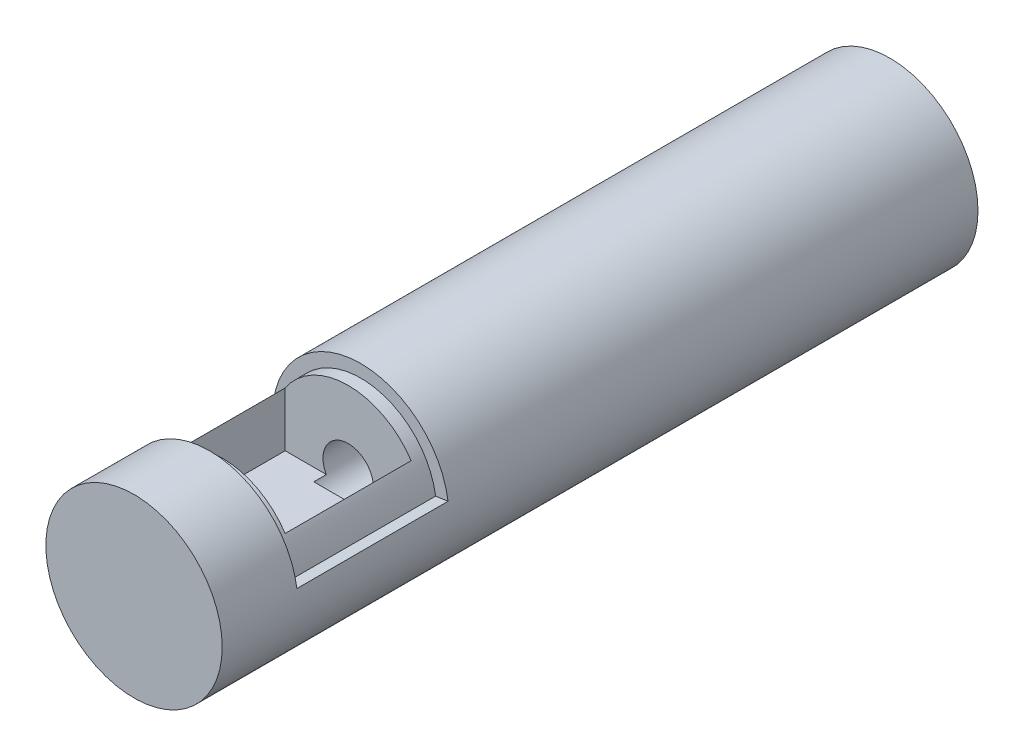
ISO-10303-21;
HEADER;
FILE_DESCRIPTION(('STEP AP214'),'2;1');
FILE_NAME('part.step','',(''),(''),'','','');
FILE_SCHEMA(('AUTOMOTIVE_DESIGN { 1 0 10303 214 1 1 1 1 }'));
ENDSEC;
DATA;
#1=APPLICATION_CONTEXT('core data for automotive mechanical design processes');
#2=APPLICATION_PROTOCOL_DEFINITION('international standard','automotive_design',2000,#1);
#3=PRODUCT_CONTEXT('',#1,'mechanical');
#4=PRODUCT('Part','Part','',(#3));
#5=PRODUCT_RELATED_PRODUCT_CATEGORY('part','',(#4));
#6=PRODUCT_DEFINITION_FORMATION('','',#4);
#7=PRODUCT_DEFINITION_CONTEXT('part definition',#1,'design');
#8=PRODUCT_DEFINITION('design','',#6,#7);
#9=PRODUCT_DEFINITION_SHAPE('','',#8);
#10=(LENGTH_UNIT() NAMED_UNIT(*) SI_UNIT(.MILLI.,.METRE.));
#11=(NAMED_UNIT(*) PLANE_ANGLE_UNIT() SI_UNIT($,.RADIAN.));
#12=(NAMED_UNIT(*) SI_UNIT($,.STERADIAN.) SOLID_ANGLE_UNIT());
#13=UNCERTAINTY_MEASURE_WITH_UNIT(LENGTH_MEASURE(1.E-05),#10,'distance_accuracy_value','');
#14=(GEOMETRIC_REPRESENTATION_CONTEXT(3) GLOBAL_UNCERTAINTY_ASSIGNED_CONTEXT((#13)) GLOBAL_UNIT_ASSIGNED_CONTEXT((#10,
#11,#12)) REPRESENTATION_CONTEXT('',''));
#15=CARTESIAN_POINT('',(0.,0.,0.));
#16=DIRECTION('',(0.,0.,1.));
#17=DIRECTION('',(1.,0.,0.));
#18=AXIS2_PLACEMENT_3D('',#15,#16,#17);
#19=CARTESIAN_POINT('',(0.,0.,-50.8));
#20=DIRECTION('',(0.,0.,-1.));
#21=DIRECTION('',(-1.,0.,0.));
#22=AXIS2_PLACEMENT_3D('',#19,#20,#21);
#23=CYLINDRICAL_SURFACE('',#22,6.35);
#24=CARTESIAN_POINT('',(0.,0.,-174.625));
#25=DIRECTION('',(0.,0.707106781186547,-0.707106781186547));
#26=DIRECTION('',(0.,-0.707106781186547,-0.707106781186547));
#27=AXIS2_PLACEMENT_3D('',#24,#25,#26);
#28=ELLIPSE('',#27,8.98025612106915,6.35);
#29=CARTESIAN_POINT('',(-6.35,0.,-174.625));
#30=VERTEX_POINT('',#29);
#31=CARTESIAN_POINT('',(6.35,0.,-174.625));
#32=VERTEX_POINT('',#31);
#33=EDGE_CURVE('E146',#30,#32,#28,.F.);
#34=ORIENTED_EDGE('',*,*,#33,.T.);
#35=CARTESIAN_POINT('',(0.,0.,-174.625));
#36=DIRECTION('',(0.,-0.707106781186547,-0.707106781186547));
#37=DIRECTION('',(0.,0.707106781186547,-0.707106781186547));
#38=AXIS2_PLACEMENT_3D('',#35,#36,#37);
#39=ELLIPSE('',#38,8.98025612106915,6.35);
#40=EDGE_CURVE('E79',#32,#30,#39,.T.);
#41=ORIENTED_EDGE('',*,*,#40,.T.);
#42=EDGE_LOOP('',(#34,#41));
#43=FACE_BOUND('',#42,.T.);
#44=CARTESIAN_POINT('',(0.,0.,-190.5));
#45=DIRECTION('',(0.,0.,-1.));
#46=DIRECTION('',(-1.,0.,0.));
#47=AXIS2_PLACEMENT_3D('',#44,#45,#46);
#48=CIRCLE('',#47,6.35);
#49=CARTESIAN_POINT('',(-6.35,0.,-190.5));
#50=VERTEX_POINT('',#49);
#51=EDGE_CURVE('E228',#50,#50,#48,.T.);
#52=ORIENTED_EDGE('',*,*,#51,.T.);
#53=EDGE_LOOP('',(#52));
#54=FACE_BOUND('',#53,.T.);
#55=DIRECTION('',(0.,0.,-1.));
#56=VECTOR('',#55,1.);
#57=CARTESIAN_POINT('',(5.49926131403118,-3.175,-50.8));
#58=LINE('',#57,#56);
#59=CARTESIAN_POINT('',(5.49926131403118,-3.175,-53.975));
#60=VERTEX_POINT('',#59);
#61=CARTESIAN_POINT('',(5.49926131403118,-3.175,-50.8));
#62=VERTEX_POINT('',#61);
#63=EDGE_CURVE('E87',#60,#62,#58,.F.);
#64=ORIENTED_EDGE('',*,*,#63,.F.);
#65=CARTESIAN_POINT('',(0.,0.,-53.975));
#66=DIRECTION('',(0.,0.,-1.));
#67=DIRECTION('',(-1.,0.,0.));
#68=AXIS2_PLACEMENT_3D('',#65,#66,#67);
#69=CIRCLE('',#68,6.35);
#70=CARTESIAN_POINT('',(-5.49926131403118,-3.175,-53.975));
#71=VERTEX_POINT('',#70);
#72=EDGE_CURVE('E177',#60,#71,#69,.F.);
#73=ORIENTED_EDGE('',*,*,#72,.T.);
#74=DIRECTION('',(0.,0.,-1.));
#75=VECTOR('',#74,1.);
#76=CARTESIAN_POINT('',(-5.49926131403118,-3.175,-50.8));
#77=LINE('',#76,#75);
#78=CARTESIAN_POINT('',(-5.49926131403118,-3.175,-50.8));
#79=VERTEX_POINT('',#78);
#80=EDGE_CURVE('E187',#79,#71,#77,.T.);
#81=ORIENTED_EDGE('',*,*,#80,.F.);
#82=CARTESIAN_POINT('',(0.,0.,-50.8));
#83=DIRECTION('',(0.,0.,-1.));
#84=DIRECTION('',(-1.,0.,0.));
#85=AXIS2_PLACEMENT_3D('',#82,#83,#84);
#86=CIRCLE('',#85,6.35);
#87=EDGE_CURVE('E231',#62,#79,#86,.T.);
#88=ORIENTED_EDGE('',*,*,#87,.F.);
#89=EDGE_LOOP('',(#64,#73,#81,#88));
#90=FACE_BOUND('',#89,.T.);
#91=ADVANCED_FACE('F61',(#43,#54,#90),#23,.F.);
#92=CARTESIAN_POINT('',(0.,0.,-50.8));
#93=DIRECTION('',(0.,0.,-1.));
#94=DIRECTION('',(-1.,0.,0.));
#95=AXIS2_PLACEMENT_3D('',#92,#93,#94);
#96=PLANE('',#95);
#97=ORIENTED_EDGE('',*,*,#87,.T.);
#98=DIRECTION('',(1.,0.,0.));
#99=VECTOR('',#98,1.);
#100=CARTESIAN_POINT('',(0.,-3.175,-50.8));
#101=LINE('',#100,#99);
#102=EDGE_CURVE('E73',#79,#62,#101,.T.);
#103=ORIENTED_EDGE('',*,*,#102,.T.);
#104=EDGE_LOOP('',(#97,#103));
#105=FACE_BOUND('',#104,.T.);
#106=ADVANCED_FACE('F284',(#105),#96,.T.);
#107=CARTESIAN_POINT('',(0.,0.,-190.5));
#108=DIRECTION('',(0.,0.,1.));
#109=DIRECTION('',(1.,0.,0.));
#110=AXIS2_PLACEMENT_3D('',#107,#108,#109);
#111=CYLINDRICAL_SURFACE('',#110,22.225);
#112=CARTESIAN_POINT('',(0.,-22.225,-180.975));
#113=CARTESIAN_POINT('',(0.174607225843672,-22.22500466078,-180.975007000145));
#114=CARTESIAN_POINT('',(0.349145676414636,-22.2229397533426,-180.96779789574));
#115=CARTESIAN_POINT('',(0.696988519144419,-22.2147481167108,-180.939042280245));
#116=CARTESIAN_POINT('',(0.870292828276681,-22.2086211168013,-180.917494813585));
#117=CARTESIAN_POINT('',(1.21437514514276,-22.1924673773701,-180.860240793684));
#118=CARTESIAN_POINT('',(1.38515279448038,-22.182440090011,-180.824532251352));
#119=CARTESIAN_POINT('',(1.72302009773866,-22.1587570214081,-180.739251134518));
#120=CARTESIAN_POINT('',(1.89010836488564,-22.1450999000995,-180.689673439435));
#121=CARTESIAN_POINT('',(2.2190834151464,-22.1145548995916,-180.577170697377));
#122=CARTESIAN_POINT('',(2.3809789965358,-22.0976728635878,-180.514269768564));
#123=CARTESIAN_POINT('',(2.6988690410669,-22.0611047907319,-180.375538817594));
#124=CARTESIAN_POINT('',(2.85486129536683,-22.0414177171969,-180.299704013298));
#125=CARTESIAN_POINT('',(3.15984930758175,-21.999764787099,-180.135699706395));
#126=CARTESIAN_POINT('',(3.30884717023756,-21.977799622524,-180.047533946592));
#127=CARTESIAN_POINT('',(3.59899575566578,-21.932156038399,-179.859468734321));
#128=CARTESIAN_POINT('',(3.74014344013891,-21.9084769635531,-179.759564784682));
#129=CARTESIAN_POINT('',(4.15683584601096,-21.8346494476341,-179.438308080656));
#130=CARTESIAN_POINT('',(4.4186521664173,-21.7827038931198,-179.1991587917));
#131=CARTESIAN_POINT('',(4.89900472413623,-21.6797370204422,-178.680515018604));
#132=CARTESIAN_POINT('',(5.11753447188942,-21.6287158419022,-178.401014495815));
#133=CARTESIAN_POINT('',(5.41037724738393,-21.556642164414,-177.954116268938));
#134=CARTESIAN_POINT('',(5.50293063287319,-21.5331428323918,-177.798796330758));
#135=CARTESIAN_POINT('',(5.67457190710557,-21.4885486379579,-177.480584815122));
#136=CARTESIAN_POINT('',(5.75366509906432,-21.4674528296637,-177.317696251999));
#137=CARTESIAN_POINT('',(5.89777555732772,-21.4283095558397,-176.985414734118));
#138=CARTESIAN_POINT('',(5.96278946902984,-21.4102628170218,-176.816020240517));
#139=CARTESIAN_POINT('',(6.07814329403662,-21.3778013854953,-176.472040953574));
#140=CARTESIAN_POINT('',(6.12848952764155,-21.3633851287767,-176.297458431595));
#141=CARTESIAN_POINT('',(6.21300222204906,-21.3389576943167,-175.94880629724));
#142=CARTESIAN_POINT('',(6.24754512308763,-21.3288444796381,-175.77483504107));
#143=CARTESIAN_POINT('',(6.30196230031207,-21.3128295427848,-175.424488799858));
#144=CARTESIAN_POINT('',(6.3218424154669,-21.3069261442212,-175.248114800155));
#145=CARTESIAN_POINT('',(6.34676930039178,-21.2995144157788,-174.89422885159));
#146=CARTESIAN_POINT('',(6.3518160324456,-21.2980060970751,-174.716716899836));
#147=CARTESIAN_POINT('',(6.34702771429538,-21.2994335853591,-174.361913628216));
#148=CARTESIAN_POINT('',(6.33719294866633,-21.3023693073646,-174.184622304198));
#149=CARTESIAN_POINT('',(6.30329952745178,-21.3124221459539,-173.837377992843));
#150=CARTESIAN_POINT('',(6.27971560711652,-21.3193996571838,-173.667374360086));
#151=CARTESIAN_POINT('',(6.21890625958517,-21.3372170797014,-173.329971330796));
#152=CARTESIAN_POINT('',(6.18167618266816,-21.348058307457,-173.162572842217));
#153=CARTESIAN_POINT('',(6.09390177541062,-21.3732792862705,-172.831634505143));
#154=CARTESIAN_POINT('',(6.04336144410366,-21.3876579744218,-172.668093513723));
#155=CARTESIAN_POINT('',(5.92934452393345,-21.4195471644876,-172.345833799455));
#156=CARTESIAN_POINT('',(5.86586304528276,-21.4370588498921,-172.187116925515));
#157=CARTESIAN_POINT('',(5.72559900968917,-21.4749500536338,-171.873662340945));
#158=CARTESIAN_POINT('',(5.64866282309198,-21.4953621202636,-171.718997338363));
#159=CARTESIAN_POINT('',(5.4825674670226,-21.5383248264677,-171.416616982485));
#160=CARTESIAN_POINT('',(5.39340383819613,-21.5608762453356,-171.268904191185));
#161=CARTESIAN_POINT('',(5.20350077301854,-21.6074931087347,-170.981409197131));
#162=CARTESIAN_POINT('',(5.10276332237518,-21.631558293231,-170.841625640096));
#163=CARTESIAN_POINT('',(4.89031372703301,-21.6805752386709,-170.57074646048));
#164=CARTESIAN_POINT('',(4.77859746176929,-21.7055273302279,-170.439654131038));
#165=CARTESIAN_POINT('',(4.54054298598351,-21.7565957301704,-170.182271777041));
#166=CARTESIAN_POINT('',(4.41381438091843,-21.7827207008736,-170.056344254923));
#167=CARTESIAN_POINT('',(4.15010088279959,-21.8344990105781,-169.815523982278));
#168=CARTESIAN_POINT('',(4.0131123567854,-21.8601521784744,-169.700635173664));
#169=CARTESIAN_POINT('',(3.72981121559586,-21.9102674512931,-169.482730107969));
#170=CARTESIAN_POINT('',(3.58349950159207,-21.9347296709296,-169.379712706102));
#171=CARTESIAN_POINT('',(3.28249151919089,-21.9817896276744,-169.186272725273));
#172=CARTESIAN_POINT('',(3.12779542709757,-22.0043874039625,-169.095849881619));
#173=CARTESIAN_POINT('',(2.81011620068692,-22.0472153627115,-168.927787992807));
#174=CARTESIAN_POINT('',(2.64709000503634,-22.067430971662,-168.850226563005));
#175=CARTESIAN_POINT('',(2.31477969497399,-22.1047587984593,-168.709185381412));
#176=CARTESIAN_POINT('',(2.14549787853616,-22.1218721425311,-168.645700517485));
#177=CARTESIAN_POINT('',(1.80184247289215,-22.1525110172998,-168.533321719648));
#178=CARTESIAN_POINT('',(1.62746898352202,-22.1660366182917,-168.484427499858));
#179=CARTESIAN_POINT('',(1.27493292683383,-22.1891047201282,-168.401670884917));
#180=CARTESIAN_POINT('',(1.09677047966621,-22.1986473470784,-168.367808013854));
#181=CARTESIAN_POINT('',(0.743952724432621,-22.2132235092098,-168.316294734194));
#182=CARTESIAN_POINT('',(0.569375730557627,-22.2183954670131,-168.298146138706));
#183=CARTESIAN_POINT('',(0.219182329868325,-22.2246093389965,-168.27635875507));
#184=CARTESIAN_POINT('',(0.0435655857163353,-22.2256498298582,-168.27272496737));
#185=CARTESIAN_POINT('',(-0.307257218845332,-22.2235680117226,-168.280012858105));
#186=CARTESIAN_POINT('',(-0.482463433412099,-22.2204476578164,-168.290927700453));
#187=CARTESIAN_POINT('',(-0.831313646661256,-22.2101329121881,-168.327208233332));
#188=CARTESIAN_POINT('',(-1.00495707846109,-22.2029370982117,-168.352578968701));
#189=CARTESIAN_POINT('',(-1.34583724633766,-22.1848571496626,-168.416885036486));
#190=CARTESIAN_POINT('',(-1.51313242385073,-22.1740512025724,-168.455533272011));
#191=CARTESIAN_POINT('',(-1.84380894047709,-22.1490065064468,-168.546162981082));
#192=CARTESIAN_POINT('',(-2.00719021568523,-22.1347677014026,-168.598144672172));
#193=CARTESIAN_POINT('',(-2.32899182418067,-22.103225306146,-168.715041459803));
#194=CARTESIAN_POINT('',(-2.48741102805872,-22.0859210240855,-168.779959476361));
#195=CARTESIAN_POINT('',(-2.79819257020641,-22.0487013783144,-168.922209792123));
#196=CARTESIAN_POINT('',(-2.95055670323331,-22.0287867959486,-168.999538378003));
#197=CARTESIAN_POINT('',(-3.25161632407704,-21.9863874139114,-169.167904887254));
#198=CARTESIAN_POINT('',(-3.40015762640932,-21.96385575207,-169.259206721615));
#199=CARTESIAN_POINT('',(-3.68901354818146,-21.9171897238231,-169.453542590488));
#200=CARTESIAN_POINT('',(-3.82933083327726,-21.8930558822032,-169.556572791261));
#201=CARTESIAN_POINT('',(-4.10100910871132,-21.8437959526458,-169.773764492012));
#202=CARTESIAN_POINT('',(-4.23236517184335,-21.8186693306413,-169.887932033206));
#203=CARTESIAN_POINT('',(-4.48519196953456,-21.7681027164706,-170.126582192376));
#204=CARTESIAN_POINT('',(-4.60666604163568,-21.7426628334755,-170.251061298819));
#205=CARTESIAN_POINT('',(-4.84288259165128,-21.6912933107398,-170.513889280517));
#206=CARTESIAN_POINT('',(-4.95726865795674,-21.6653753733001,-170.652561057797));
#207=CARTESIAN_POINT('',(-5.17392399901038,-21.6146596930875,-170.939179652303));
#208=CARTESIAN_POINT('',(-5.27619763987138,-21.5898615486744,-171.087123097827));
#209=CARTESIAN_POINT('',(-5.46798433200695,-21.5420877905565,-171.391425524585));
#210=CARTESIAN_POINT('',(-5.55749251880891,-21.5191128730918,-171.547787682801));
#211=CARTESIAN_POINT('',(-5.72298911056296,-21.4756918620206,-171.867768537723));
#212=CARTESIAN_POINT('',(-5.79898304617396,-21.4552447349741,-172.031384231539));
#213=CARTESIAN_POINT('',(-5.9365396447661,-21.4175905719465,-172.363977988057));
#214=CARTESIAN_POINT('',(-5.99817191871734,-21.4003679900347,-172.532925478532));
#215=CARTESIAN_POINT('',(-6.10693814807914,-21.3695841992497,-172.875680207273));
#216=CARTESIAN_POINT('',(-6.15407783400497,-21.3560215434648,-173.049485494982));
#217=CARTESIAN_POINT('',(-6.23346315011019,-21.3329855703873,-173.400723733008));
#218=CARTESIAN_POINT('',(-6.26570961812217,-21.3235120230598,-173.578156478672));
#219=CARTESIAN_POINT('',(-6.3150061115508,-21.3089649367854,-173.935297602168));
#220=CARTESIAN_POINT('',(-6.33205664749832,-21.3038912500184,-174.115005903344));
#221=CARTESIAN_POINT('',(-6.35044160453721,-21.2984178243426,-174.468447200639));
#222=CARTESIAN_POINT('',(-6.35234805550104,-21.2978479688049,-174.64214805843));
#223=CARTESIAN_POINT('',(-6.34192685087219,-21.3009534768702,-174.989145272331));
#224=CARTESIAN_POINT('',(-6.32959431580944,-21.3046302957399,-175.162441469374));
#225=CARTESIAN_POINT('',(-6.29080675631152,-21.3161155539105,-175.507233416932));
#226=CARTESIAN_POINT('',(-6.26435749705271,-21.3239223065622,-175.678729873317));
#227=CARTESIAN_POINT('',(-6.19756182631833,-21.3434313350994,-176.01883356452));
#228=CARTESIAN_POINT('',(-6.1572102291451,-21.3551350645375,-176.187439696552));
#229=CARTESIAN_POINT('',(-6.06345639768136,-21.3819426028597,-176.51875915858));
#230=CARTESIAN_POINT('',(-6.01019706330067,-21.3970090481968,-176.681516012569));
#231=CARTESIAN_POINT('',(-5.89081536445784,-21.4301832856134,-177.00198183882));
#232=CARTESIAN_POINT('',(-5.82468863175085,-21.4482921102387,-177.159689075595));
#233=CARTESIAN_POINT('',(-5.68008093015661,-21.4870403960369,-177.46899824827));
#234=CARTESIAN_POINT('',(-5.60160050110819,-21.5076797466209,-177.620600450586));
#235=CARTESIAN_POINT('',(-5.43283234031519,-21.5509290543146,-177.916791048937));
#236=CARTESIAN_POINT('',(-5.3425441849238,-21.5735390821202,-178.061379193062));
#237=CARTESIAN_POINT('',(-5.14753713175861,-21.6209131624242,-178.347407473519));
#238=CARTESIAN_POINT('',(-5.04243563203112,-21.6457240385645,-178.488579123956));
#239=CARTESIAN_POINT('',(-4.82099597145663,-21.6961173737301,-178.761590687076));
#240=CARTESIAN_POINT('',(-4.704661274486,-21.7216995932405,-178.893433454827));
#241=CARTESIAN_POINT('',(-4.46140202246057,-21.7729642592041,-179.147088921341));
#242=CARTESIAN_POINT('',(-4.33447133047582,-21.7986467554119,-179.268895725244));
#243=CARTESIAN_POINT('',(-4.07092330829059,-21.8493983436695,-179.501573851928));
#244=CARTESIAN_POINT('',(-3.93430945468405,-21.8744676515707,-179.612449065689));
#245=CARTESIAN_POINT('',(-3.64851861662803,-21.9239710421485,-179.825324946615));
#246=CARTESIAN_POINT('',(-3.49910683664381,-21.9483714820997,-179.92701856529));
#247=CARTESIAN_POINT('',(-3.19198527317929,-21.9951352780637,-180.117391394475));
#248=CARTESIAN_POINT('',(-3.0342785501315,-22.0174993771849,-180.206075359791));
#249=CARTESIAN_POINT('',(-2.71161813866321,-22.0595600909471,-180.369765503219));
#250=CARTESIAN_POINT('',(-2.54666643967777,-22.0792574318767,-180.444775407383));
#251=CARTESIAN_POINT('',(-2.21070333032166,-22.1154247466361,-180.58051367037));
#252=CARTESIAN_POINT('',(-2.03969261007306,-22.1318950866347,-180.641243649697));
#253=CARTESIAN_POINT('',(-1.56517340936979,-22.1718693739984,-180.787122909563));
#254=CARTESIAN_POINT('',(-1.25663401281967,-22.1916495714737,-180.857428524288));
#255=CARTESIAN_POINT('',(-0.631987368854698,-22.2182097989389,-180.951357614763));
#256=CARTESIAN_POINT('',(-0.31588113966375,-22.224991568204,-180.974987336069));
#257=CARTESIAN_POINT('',(0.,-22.225,-180.975));
#258=B_SPLINE_CURVE_WITH_KNOTS('',3,(#112,#113,#114,#115,#116,#117,#118,#119,#120,#121,#122,
#123,#124,#125,#126,#127,#128,#129,#130,#131,#132,#133,#134,#135,#136,#137,#138,#139,#140,#141,
#142,#143,#144,#145,#146,#147,#148,#149,#150,#151,#152,#153,#154,#155,#156,#157,#158,#159,#160,
#161,#162,#163,#164,#165,#166,#167,#168,#169,#170,#171,#172,#173,#174,#175,#176,#177,#178,#179,
#180,#181,#182,#183,#184,#185,#186,#187,#188,#189,#190,#191,#192,#193,#194,#195,#196,#197,#198,
#199,#200,#201,#202,#203,#204,#205,#206,#207,#208,#209,#210,#211,#212,#213,#214,#215,#216,#217,
#218,#219,#220,#221,#222,#223,#224,#225,#226,#227,#228,#229,#230,#231,#232,#233,#234,#235,#236,
#237,#238,#239,#240,#241,#242,#243,#244,#245,#246,#247,#248,#249,#250,#251,#252,#253,#254,#255,
#256,#257),.UNSPECIFIED.,.T.,.F.,(4,2,2,2,2,2,2,2,2,2,2,2,2,2,2,2,2,2,2,2,2,2,2,2,2,2,2,2,2,2,2,
2,2,2,2,2,2,2,2,2,2,2,2,2,2,2,2,2,2,2,2,2,2,2,2,2,2,2,2,2,2,2,2,2,2,2,2,2,2,2,2,2,4),(0.,
0.523542446209641,1.04711978703388,1.57077069652868,2.09461519704669,2.61751939960571,
3.14061736023111,3.66355688857244,4.18669742450998,5.25663870560567,6.32674027199375,
6.87315364575364,7.41935123580061,7.96567882288871,8.51177064813153,9.04407366106257,
9.57616458732904,10.1082568665205,10.6403389707794,11.1550542794571,11.669945132855,
12.184681464682,12.6996126503292,13.2208612849843,13.7423005273527,14.2636504401906,
14.7851967786712,15.3262321481628,15.8674600082566,16.4086356328414,16.9497998821669,
17.4941196054675,18.0382413251856,18.5823523830771,19.1264462124877,19.6525829097631,
20.1789008489756,20.704971569867,21.2312259921592,21.7467512827747,22.262284985019,
22.7779351867726,23.2934313892439,23.8202551368941,24.346907169571,24.8738464789751,
25.4006070746706,25.9448215414263,26.4888392366245,27.0330636873728,27.5770649010805,
28.1183717890939,28.6594643628085,29.2005264931209,29.7415704449278,30.2620757935736,
30.7827595639318,31.303230853024,31.8238964931755,32.3390419823483,32.8543626600007,
33.3696608251256,33.8849774835947,34.4175878862527,34.9500345741247,35.4827918100006,
36.0153587269311,36.5618217725519,37.1080845950459,37.6541983429302,38.2002500872101,
39.1475151092326,40.0946533721078),.UNSPECIFIED.);
#259=CARTESIAN_POINT('',(0.,-22.225,-180.975));
#260=VERTEX_POINT('',#259);
#261=EDGE_CURVE('E14',#260,#260,#258,.T.);
#262=ORIENTED_EDGE('',*,*,#261,.F.);
#263=EDGE_LOOP('',(#262));
#264=FACE_BOUND('',#263,.T.);
#265=DIRECTION('',(0.,0.,1.));
#266=VECTOR('',#265,1.);
#267=CARTESIAN_POINT('',(-22.0005958723705,3.15030256652217,-57.15));
#268=LINE('',#267,#266);
#269=CARTESIAN_POINT('',(-22.0005958723705,3.15030256652217,-57.15));
#270=VERTEX_POINT('',#269);
#271=CARTESIAN_POINT('',(-22.0005958723705,3.15030256652217,-19.05));
#272=VERTEX_POINT('',#271);
#273=EDGE_CURVE('E196',#270,#272,#268,.T.);
#274=ORIENTED_EDGE('',*,*,#273,.F.);
#275=CARTESIAN_POINT('',(0.,0.,-57.15));
#276=DIRECTION('',(0.,0.,1.));
#277=DIRECTION('',(-0.989903076372124,0.141745897256341,0.));
#278=AXIS2_PLACEMENT_3D('',#275,#276,#277);
#279=CIRCLE('',#278,22.225);
#280=CARTESIAN_POINT('',(22.0005958723705,3.15030256652214,-57.15));
#281=VERTEX_POINT('',#280);
#282=EDGE_CURVE('E200',#281,#270,#279,.T.);
#283=ORIENTED_EDGE('',*,*,#282,.F.);
#284=DIRECTION('',(0.,0.,-1.));
#285=VECTOR('',#284,1.);
#286=CARTESIAN_POINT('',(22.0005958723705,3.15030256652215,-19.05));
#287=LINE('',#286,#285);
#288=CARTESIAN_POINT('',(22.0005958723705,3.15030256652214,-19.05));
#289=VERTEX_POINT('',#288);
#290=EDGE_CURVE('E204',#289,#281,#287,.T.);
#291=ORIENTED_EDGE('',*,*,#290,.F.);
#292=CARTESIAN_POINT('',(0.,0.,-19.05));
#293=DIRECTION('',(0.,0.,1.));
#294=DIRECTION('',(-0.989903076372124,0.141745897256341,0.));
#295=AXIS2_PLACEMENT_3D('',#292,#293,#294);
#296=CIRCLE('',#295,22.225);
#297=EDGE_CURVE('E191',#289,#272,#296,.T.);
#298=ORIENTED_EDGE('',*,*,#297,.T.);
#299=EDGE_LOOP('',(#274,#283,#291,#298));
#300=FACE_BOUND('',#299,.T.);
#301=CARTESIAN_POINT('',(0.,0.,-190.5));
#302=DIRECTION('',(0.,0.,1.));
#303=DIRECTION('',(1.,0.,0.));
#304=AXIS2_PLACEMENT_3D('',#301,#302,#303);
#305=CIRCLE('',#304,22.225);
#306=CARTESIAN_POINT('',(22.225,0.,-190.5));
#307=VERTEX_POINT('',#306);
#308=EDGE_CURVE('E237',#307,#307,#305,.T.);
#309=ORIENTED_EDGE('',*,*,#308,.T.);
#310=EDGE_LOOP('',(#309));
#311=FACE_BOUND('',#310,.T.);
#312=CARTESIAN_POINT('',(0.,0.,0.));
#313=DIRECTION('',(0.,0.,1.));
#314=DIRECTION('',(1.,0.,0.));
#315=AXIS2_PLACEMENT_3D('',#312,#313,#314);
#316=CIRCLE('',#315,22.225);
#317=CARTESIAN_POINT('',(22.225,0.,0.));
#318=VERTEX_POINT('',#317);
#319=EDGE_CURVE('E234',#318,#318,#316,.T.);
#320=ORIENTED_EDGE('',*,*,#319,.F.);
#321=EDGE_LOOP('',(#320));
#322=FACE_BOUND('',#321,.T.);
#323=ADVANCED_FACE('F63',(#264,#300,#311,#322),#111,.T.);
#324=CARTESIAN_POINT('',(0.,0.,-190.5));
#325=DIRECTION('',(0.,0.,1.));
#326=DIRECTION('',(1.,0.,0.));
#327=AXIS2_PLACEMENT_3D('',#324,#325,#326);
#328=PLANE('',#327);
#329=ORIENTED_EDGE('',*,*,#51,.F.);
#330=EDGE_LOOP('',(#329));
#331=FACE_BOUND('',#330,.T.);
#332=ORIENTED_EDGE('',*,*,#308,.F.);
#333=EDGE_LOOP('',(#332));
#334=FACE_BOUND('',#333,.T.);
#335=ADVANCED_FACE('F295',(#331,#334),#328,.F.);
#336=CARTESIAN_POINT('',(0.,0.,0.));
#337=DIRECTION('',(0.,0.,1.));
#338=DIRECTION('',(1.,0.,0.));
#339=AXIS2_PLACEMENT_3D('',#336,#337,#338);
#340=PLANE('',#339);
#341=ORIENTED_EDGE('',*,*,#319,.T.);
#342=EDGE_LOOP('',(#341));
#343=FACE_BOUND('',#342,.T.);
#344=ADVANCED_FACE('F297',(#343),#340,.T.);
#345=CARTESIAN_POINT('',(-22.0005958723705,3.15030256652217,-38.1));
#346=DIRECTION('',(-0.141745897256341,-0.989903076372124,0.));
#347=DIRECTION('',(0.,0.,1.));
#348=AXIS2_PLACEMENT_3D('',#345,#346,#347);
#349=PLANE('',#348);
#350=DIRECTION('',(-0.989903076372124,0.141745897256341,0.));
#351=VECTOR('',#350,1.);
#352=CARTESIAN_POINT('',(-22.0005958723705,3.15030256652217,-57.15));
#353=LINE('',#352,#351);
#354=CARTESIAN_POINT('',(-18.857653604889,2.70025934273329,-57.15));
#355=VERTEX_POINT('',#354);
#356=EDGE_CURVE('E226',#355,#270,#353,.T.);
#357=ORIENTED_EDGE('',*,*,#356,.T.);
#358=ORIENTED_EDGE('',*,*,#273,.T.);
#359=DIRECTION('',(-0.989903076372124,0.141745897256341,0.));
#360=VECTOR('',#359,1.);
#361=CARTESIAN_POINT('',(-22.0005958723705,3.15030256652217,-19.05));
#362=LINE('',#361,#360);
#363=CARTESIAN_POINT('',(-18.857653604889,2.70025934273329,-19.05));
#364=VERTEX_POINT('',#363);
#365=EDGE_CURVE('E224',#364,#272,#362,.T.);
#366=ORIENTED_EDGE('',*,*,#365,.F.);
#367=DIRECTION('',(0.,0.,1.));
#368=VECTOR('',#367,1.);
#369=CARTESIAN_POINT('',(-18.857653604889,2.70025934273329,-190.5));
#370=LINE('',#369,#368);
#371=EDGE_CURVE('E215',#355,#364,#370,.T.);
#372=ORIENTED_EDGE('',*,*,#371,.F.);
#373=EDGE_LOOP('',(#357,#358,#366,#372));
#374=FACE_BOUND('',#373,.T.);
#375=ADVANCED_FACE('F300',(#374),#349,.F.);
#376=CARTESIAN_POINT('',(0.,0.,-19.05));
#377=DIRECTION('',(0.,0.,-1.));
#378=DIRECTION('',(-1.,0.,0.));
#379=AXIS2_PLACEMENT_3D('',#376,#377,#378);
#380=PLANE('',#379);
#381=ORIENTED_EDGE('',*,*,#365,.T.);
#382=ORIENTED_EDGE('',*,*,#297,.F.);
#383=DIRECTION('',(0.989903076372124,0.141745897256339,0.));
#384=VECTOR('',#383,1.);
#385=CARTESIAN_POINT('',(22.0005958723705,3.15030256652214,-19.05));
#386=LINE('',#385,#384);
#387=CARTESIAN_POINT('',(18.857653604889,2.70025934273328,-19.05));
#388=VERTEX_POINT('',#387);
#389=EDGE_CURVE('E222',#388,#289,#386,.T.);
#390=ORIENTED_EDGE('',*,*,#389,.F.);
#391=CARTESIAN_POINT('',(0.,0.,-19.05));
#392=DIRECTION('',(0.,0.,1.));
#393=DIRECTION('',(1.,0.,0.));
#394=AXIS2_PLACEMENT_3D('',#391,#392,#393);
#395=CIRCLE('',#394,19.05);
#396=EDGE_CURVE('E207',#388,#364,#395,.T.);
#397=ORIENTED_EDGE('',*,*,#396,.T.);
#398=EDGE_LOOP('',(#381,#382,#390,#397));
#399=FACE_BOUND('',#398,.T.);
#400=ADVANCED_FACE('F305',(#399),#380,.T.);
#401=CARTESIAN_POINT('',(22.0005958723705,3.15030256652216,-38.1));
#402=DIRECTION('',(0.14174589725634,-0.989903076372124,0.));
#403=DIRECTION('',(0.,0.,-1.));
#404=AXIS2_PLACEMENT_3D('',#401,#402,#403);
#405=PLANE('',#404);
#406=ORIENTED_EDGE('',*,*,#389,.T.);
#407=ORIENTED_EDGE('',*,*,#290,.T.);
#408=DIRECTION('',(0.989903076372124,0.141745897256339,0.));
#409=VECTOR('',#408,1.);
#410=CARTESIAN_POINT('',(22.0005958723705,3.15030256652214,-57.15));
#411=LINE('',#410,#409);
#412=CARTESIAN_POINT('',(18.857653604889,2.70025934273328,-57.15));
#413=VERTEX_POINT('',#412);
#414=EDGE_CURVE('E195',#413,#281,#411,.T.);
#415=ORIENTED_EDGE('',*,*,#414,.F.);
#416=DIRECTION('',(0.,0.,1.));
#417=VECTOR('',#416,1.);
#418=CARTESIAN_POINT('',(18.857653604889,2.70025934273328,-190.5));
#419=LINE('',#418,#417);
#420=EDGE_CURVE('E190',#388,#413,#419,.F.);
#421=ORIENTED_EDGE('',*,*,#420,.F.);
#422=EDGE_LOOP('',(#406,#407,#415,#421));
#423=FACE_BOUND('',#422,.T.);
#424=ADVANCED_FACE('F329',(#423),#405,.F.);
#425=CARTESIAN_POINT('',(0.,0.,-57.15));
#426=DIRECTION('',(0.,0.,-1.));
#427=DIRECTION('',(-1.,0.,0.));
#428=AXIS2_PLACEMENT_3D('',#425,#426,#427);
#429=PLANE('',#428);
#430=CARTESIAN_POINT('',(0.,0.,-57.15));
#431=DIRECTION('',(0.,0.,1.));
#432=DIRECTION('',(1.,0.,0.));
#433=AXIS2_PLACEMENT_3D('',#430,#431,#432);
#434=CIRCLE('',#433,19.05);
#435=EDGE_CURVE('E211',#413,#355,#434,.T.);
#436=ORIENTED_EDGE('',*,*,#435,.F.);
#437=ORIENTED_EDGE('',*,*,#414,.T.);
#438=ORIENTED_EDGE('',*,*,#282,.T.);
#439=ORIENTED_EDGE('',*,*,#356,.F.);
#440=EDGE_LOOP('',(#436,#437,#438,#439));
#441=FACE_BOUND('',#440,.T.);
#442=ADVANCED_FACE('F326',(#441),#429,.F.);
#443=CARTESIAN_POINT('',(0.,0.,-190.5));
#444=DIRECTION('',(0.,0.,1.));
#445=DIRECTION('',(1.,0.,0.));
#446=AXIS2_PLACEMENT_3D('',#443,#444,#445);
#447=CYLINDRICAL_SURFACE('',#446,19.05);
#448=CARTESIAN_POINT('',(0.,0.,-22.225));
#449=DIRECTION('',(0.,0.,1.));
#450=DIRECTION('',(1.,0.,0.));
#451=AXIS2_PLACEMENT_3D('',#448,#449,#450);
#452=CIRCLE('',#451,19.05);
#453=CARTESIAN_POINT('',(-15.875,10.5302837093783,-22.225));
#454=VERTEX_POINT('',#453);
#455=CARTESIAN_POINT('',(15.875,10.5302837093784,-22.225));
#456=VERTEX_POINT('',#455);
#457=EDGE_CURVE('E248',#454,#456,#452,.F.);
#458=ORIENTED_EDGE('',*,*,#457,.F.);
#459=DIRECTION('',(0.,0.,1.));
#460=VECTOR('',#459,1.);
#461=CARTESIAN_POINT('',(-15.875,10.5302837093783,-190.5));
#462=LINE('',#461,#460);
#463=CARTESIAN_POINT('',(-15.875,10.5302837093784,-53.975));
#464=VERTEX_POINT('',#463);
#465=EDGE_CURVE('E246',#464,#454,#462,.T.);
#466=ORIENTED_EDGE('',*,*,#465,.F.);
#467=CARTESIAN_POINT('',(0.,0.,-53.975));
#468=DIRECTION('',(0.,0.,-1.));
#469=DIRECTION('',(-1.,0.,0.));
#470=AXIS2_PLACEMENT_3D('',#467,#468,#469);
#471=CIRCLE('',#470,19.05);
#472=CARTESIAN_POINT('',(15.875,10.5302837093784,-53.975));
#473=VERTEX_POINT('',#472);
#474=EDGE_CURVE('E244',#473,#464,#471,.F.);
#475=ORIENTED_EDGE('',*,*,#474,.F.);
#476=DIRECTION('',(0.,0.,1.));
#477=VECTOR('',#476,1.);
#478=CARTESIAN_POINT('',(15.875,10.5302837093784,-190.5));
#479=LINE('',#478,#477);
#480=EDGE_CURVE('E240',#456,#473,#479,.F.);
#481=ORIENTED_EDGE('',*,*,#480,.F.);
#482=EDGE_LOOP('',(#458,#466,#475,#481));
#483=FACE_BOUND('',#482,.T.);
#484=ORIENTED_EDGE('',*,*,#420,.T.);
#485=ORIENTED_EDGE('',*,*,#435,.T.);
#486=ORIENTED_EDGE('',*,*,#371,.T.);
#487=ORIENTED_EDGE('',*,*,#396,.F.);
#488=EDGE_LOOP('',(#484,#485,#486,#487));
#489=FACE_BOUND('',#488,.T.);
#490=ADVANCED_FACE('F263',(#483,#489),#447,.T.);
#491=CARTESIAN_POINT('',(0.,-3.175,0.));
#492=DIRECTION('',(0.,1.,0.));
#493=DIRECTION('',(0.,0.,1.));
#494=AXIS2_PLACEMENT_3D('',#491,#492,#493);
#495=PLANE('',#494);
#496=CARTESIAN_POINT('',(8.255,-3.175,-46.355));
#497=DIRECTION('',(0.,1.,0.));
#498=DIRECTION('',(0.,0.,1.));
#499=AXIS2_PLACEMENT_3D('',#496,#497,#498);
#500=CIRCLE('',#499,1.190625);
#501=CARTESIAN_POINT('',(8.255,-3.175,-45.164375));
#502=VERTEX_POINT('',#501);
#503=EDGE_CURVE('E154',#502,#502,#500,.T.);
#504=ORIENTED_EDGE('',*,*,#503,.F.);
#505=EDGE_LOOP('',(#504));
#506=FACE_BOUND('',#505,.T.);
#507=CARTESIAN_POINT('',(-8.255,-3.175,-29.845));
#508=DIRECTION('',(0.,1.,0.));
#509=DIRECTION('',(0.,0.,1.));
#510=AXIS2_PLACEMENT_3D('',#507,#508,#509);
#511=CIRCLE('',#510,1.190625);
#512=CARTESIAN_POINT('',(-8.255,-3.175,-28.654375));
#513=VERTEX_POINT('',#512);
#514=EDGE_CURVE('E160',#513,#513,#511,.T.);
#515=ORIENTED_EDGE('',*,*,#514,.F.);
#516=EDGE_LOOP('',(#515));
#517=FACE_BOUND('',#516,.T.);
#518=ORIENTED_EDGE('',*,*,#63,.T.);
#519=ORIENTED_EDGE('',*,*,#102,.F.);
#520=ORIENTED_EDGE('',*,*,#80,.T.);
#521=DIRECTION('',(-1.,0.,0.));
#522=VECTOR('',#521,1.);
#523=CARTESIAN_POINT('',(-15.875,-3.175,-53.975));
#524=LINE('',#523,#522);
#525=CARTESIAN_POINT('',(-15.875,-3.175,-53.975));
#526=VERTEX_POINT('',#525);
#527=EDGE_CURVE('E167',#71,#526,#524,.T.);
#528=ORIENTED_EDGE('',*,*,#527,.T.);
#529=DIRECTION('',(0.,0.,1.));
#530=VECTOR('',#529,1.);
#531=CARTESIAN_POINT('',(-15.875,-3.175,-22.225));
#532=LINE('',#531,#530);
#533=CARTESIAN_POINT('',(-15.875,-3.175,-22.225));
#534=VERTEX_POINT('',#533);
#535=EDGE_CURVE('E170',#526,#534,#532,.T.);
#536=ORIENTED_EDGE('',*,*,#535,.T.);
#537=DIRECTION('',(1.,0.,0.));
#538=VECTOR('',#537,1.);
#539=CARTESIAN_POINT('',(-15.875,-3.175,-22.225));
#540=LINE('',#539,#538);
#541=CARTESIAN_POINT('',(15.875,-3.175,-22.225));
#542=VERTEX_POINT('',#541);
#543=EDGE_CURVE('E161',#534,#542,#540,.T.);
#544=ORIENTED_EDGE('',*,*,#543,.T.);
#545=DIRECTION('',(0.,0.,-1.));
#546=VECTOR('',#545,1.);
#547=CARTESIAN_POINT('',(15.875,-3.175,-22.225));
#548=LINE('',#547,#546);
#549=CARTESIAN_POINT('',(15.875,-3.175,-53.975));
#550=VERTEX_POINT('',#549);
#551=EDGE_CURVE('E164',#542,#550,#548,.T.);
#552=ORIENTED_EDGE('',*,*,#551,.T.);
#553=EDGE_CURVE('E168',#550,#60,#524,.T.);
#554=ORIENTED_EDGE('',*,*,#553,.T.);
#555=EDGE_LOOP('',(#518,#519,#520,#528,#536,#544,#552,#554));
#556=FACE_BOUND('',#555,.T.);
#557=ADVANCED_FACE('F259',(#506,#517,#556),#495,.T.);
#558=CARTESIAN_POINT('',(-15.875,-3.175,-53.975));
#559=DIRECTION('',(0.,0.,-1.));
#560=DIRECTION('',(-1.,0.,0.));
#561=AXIS2_PLACEMENT_3D('',#558,#559,#560);
#562=PLANE('',#561);
#563=ORIENTED_EDGE('',*,*,#553,.F.);
#564=DIRECTION('',(0.,1.,0.));
#565=VECTOR('',#564,1.);
#566=CARTESIAN_POINT('',(15.875,-3.175,-53.975));
#567=LINE('',#566,#565);
#568=EDGE_CURVE('E181',#550,#473,#567,.T.);
#569=ORIENTED_EDGE('',*,*,#568,.T.);
#570=ORIENTED_EDGE('',*,*,#474,.T.);
#571=DIRECTION('',(0.,1.,0.));
#572=VECTOR('',#571,1.);
#573=CARTESIAN_POINT('',(-15.875,-3.175,-53.975));
#574=LINE('',#573,#572);
#575=EDGE_CURVE('E178',#526,#464,#574,.T.);
#576=ORIENTED_EDGE('',*,*,#575,.F.);
#577=ORIENTED_EDGE('',*,*,#527,.F.);
#578=ORIENTED_EDGE('',*,*,#72,.F.);
#579=EDGE_LOOP('',(#563,#569,#570,#576,#577,#578));
#580=FACE_BOUND('',#579,.T.);
#581=ADVANCED_FACE('F262',(#580),#562,.F.);
#582=CARTESIAN_POINT('',(-15.875,-3.175,-22.225));
#583=DIRECTION('',(0.,0.,1.));
#584=DIRECTION('',(1.,0.,0.));
#585=AXIS2_PLACEMENT_3D('',#582,#583,#584);
#586=PLANE('',#585);
#587=ORIENTED_EDGE('',*,*,#457,.T.);
#588=DIRECTION('',(0.,1.,0.));
#589=VECTOR('',#588,1.);
#590=CARTESIAN_POINT('',(15.875,-3.175,-22.225));
#591=LINE('',#590,#589);
#592=EDGE_CURVE('E173',#542,#456,#591,.T.);
#593=ORIENTED_EDGE('',*,*,#592,.F.);
#594=ORIENTED_EDGE('',*,*,#543,.F.);
#595=DIRECTION('',(0.,1.,0.));
#596=VECTOR('',#595,1.);
#597=CARTESIAN_POINT('',(-15.875,-3.175,-22.225));
#598=LINE('',#597,#596);
#599=EDGE_CURVE('E174',#534,#454,#598,.T.);
#600=ORIENTED_EDGE('',*,*,#599,.T.);
#601=EDGE_LOOP('',(#587,#593,#594,#600));
#602=FACE_BOUND('',#601,.T.);
#603=ADVANCED_FACE('F342',(#602),#586,.F.);
#604=CARTESIAN_POINT('',(-15.875,-3.175,-22.225));
#605=DIRECTION('',(-1.,0.,0.));
#606=DIRECTION('',(0.,0.,1.));
#607=AXIS2_PLACEMENT_3D('',#604,#605,#606);
#608=PLANE('',#607);
#609=ORIENTED_EDGE('',*,*,#465,.T.);
#610=ORIENTED_EDGE('',*,*,#599,.F.);
#611=ORIENTED_EDGE('',*,*,#535,.F.);
#612=ORIENTED_EDGE('',*,*,#575,.T.);
#613=EDGE_LOOP('',(#609,#610,#611,#612));
#614=FACE_BOUND('',#613,.T.);
#615=ADVANCED_FACE('F389',(#614),#608,.F.);
#616=CARTESIAN_POINT('',(15.875,-3.175,-22.225));
#617=DIRECTION('',(1.,0.,0.));
#618=DIRECTION('',(0.,0.,-1.));
#619=AXIS2_PLACEMENT_3D('',#616,#617,#618);
#620=PLANE('',#619);
#621=ORIENTED_EDGE('',*,*,#480,.T.);
#622=ORIENTED_EDGE('',*,*,#568,.F.);
#623=ORIENTED_EDGE('',*,*,#551,.F.);
#624=ORIENTED_EDGE('',*,*,#592,.T.);
#625=EDGE_LOOP('',(#621,#622,#623,#624));
#626=FACE_BOUND('',#625,.T.);
#627=ADVANCED_FACE('F271',(#626),#620,.F.);
#628=CARTESIAN_POINT('',(-8.255,-19.2425960454009,-29.845));
#629=DIRECTION('',(0.,1.,0.));
#630=DIRECTION('',(0.,0.,1.));
#631=AXIS2_PLACEMENT_3D('',#628,#629,#630);
#632=CYLINDRICAL_SURFACE('',#631,1.190625);
#633=ORIENTED_EDGE('',*,*,#514,.T.);
#634=EDGE_LOOP('',(#633));
#635=FACE_BOUND('',#634,.T.);
#636=CARTESIAN_POINT('',(-8.255,-9.525,-29.845));
#637=DIRECTION('',(0.,1.,0.));
#638=DIRECTION('',(0.,0.,1.));
#639=AXIS2_PLACEMENT_3D('',#636,#637,#638);
#640=CIRCLE('',#639,1.190625);
#641=CARTESIAN_POINT('',(-8.255,-9.525,-28.654375));
#642=VERTEX_POINT('',#641);
#643=EDGE_CURVE('E157',#642,#642,#640,.F.);
#644=ORIENTED_EDGE('',*,*,#643,.T.);
#645=EDGE_LOOP('',(#644));
#646=FACE_BOUND('',#645,.T.);
#647=ADVANCED_FACE('F267',(#635,#646),#632,.F.);
#648=CARTESIAN_POINT('',(0.,-9.525,0.));
#649=DIRECTION('',(0.,1.,0.));
#650=DIRECTION('',(0.,0.,1.));
#651=AXIS2_PLACEMENT_3D('',#648,#649,#650);
#652=PLANE('',#651);
#653=ORIENTED_EDGE('',*,*,#643,.F.);
#654=EDGE_LOOP('',(#653));
#655=FACE_BOUND('',#654,.T.);
#656=ADVANCED_FACE('F270',(#655),#652,.T.);
#657=CARTESIAN_POINT('',(8.255,-19.2425960454009,-46.355));
#658=DIRECTION('',(0.,1.,0.));
#659=DIRECTION('',(0.,0.,1.));
#660=AXIS2_PLACEMENT_3D('',#657,#658,#659);
#661=CYLINDRICAL_SURFACE('',#660,1.190625);
#662=ORIENTED_EDGE('',*,*,#503,.T.);
#663=EDGE_LOOP('',(#662));
#664=FACE_BOUND('',#663,.T.);
#665=CARTESIAN_POINT('',(8.255,-9.525,-46.355));
#666=DIRECTION('',(0.,1.,0.));
#667=DIRECTION('',(0.,0.,1.));
#668=AXIS2_PLACEMENT_3D('',#665,#666,#667);
#669=CIRCLE('',#668,1.190625);
#670=CARTESIAN_POINT('',(8.255,-9.525,-45.164375));
#671=VERTEX_POINT('',#670);
#672=EDGE_CURVE('E151',#671,#671,#669,.F.);
#673=ORIENTED_EDGE('',*,*,#672,.T.);
#674=EDGE_LOOP('',(#673));
#675=FACE_BOUND('',#674,.T.);
#676=ADVANCED_FACE('F256',(#664,#675),#661,.F.);
#677=CARTESIAN_POINT('',(0.,-9.525,0.));
#678=DIRECTION('',(0.,1.,0.));
#679=DIRECTION('',(0.,0.,1.));
#680=AXIS2_PLACEMENT_3D('',#677,#678,#679);
#681=PLANE('',#680);
#682=ORIENTED_EDGE('',*,*,#672,.F.);
#683=EDGE_LOOP('',(#682));
#684=FACE_BOUND('',#683,.T.);
#685=ADVANCED_FACE('F280',(#684),#681,.T.);
#686=CARTESIAN_POINT('',(0.,0.,-174.625));
#687=DIRECTION('',(0.,-1.,0.));
#688=DIRECTION('',(0.,0.,-1.));
#689=AXIS2_PLACEMENT_3D('',#686,#687,#688);
#690=CYLINDRICAL_SURFACE('',#689,6.35);
#691=ORIENTED_EDGE('',*,*,#261,.T.);
#692=EDGE_LOOP('',(#691));
#693=FACE_BOUND('',#692,.T.);
#694=ORIENTED_EDGE('',*,*,#33,.F.);
#695=ORIENTED_EDGE('',*,*,#40,.F.);
#696=EDGE_LOOP('',(#694,#695));
#697=FACE_BOUND('',#696,.T.);
#698=ADVANCED_FACE('F147',(#693,#697),#690,.F.);
#699=CLOSED_SHELL('',(#91,#106,#323,#335,#344,#375,#400,#424,#442,#490,#557,#581,#603,#615,#627,
#647,#656,#676,#685,#698));
#700=MANIFOLD_SOLID_BREP('B2',#699);
#701=ADVANCED_BREP_SHAPE_REPRESENTATION('',(#18,#700),#14);
#702=SHAPE_DEFINITION_REPRESENTATION(#9,#701);
ENDSEC;
END-ISO-10303-21;
